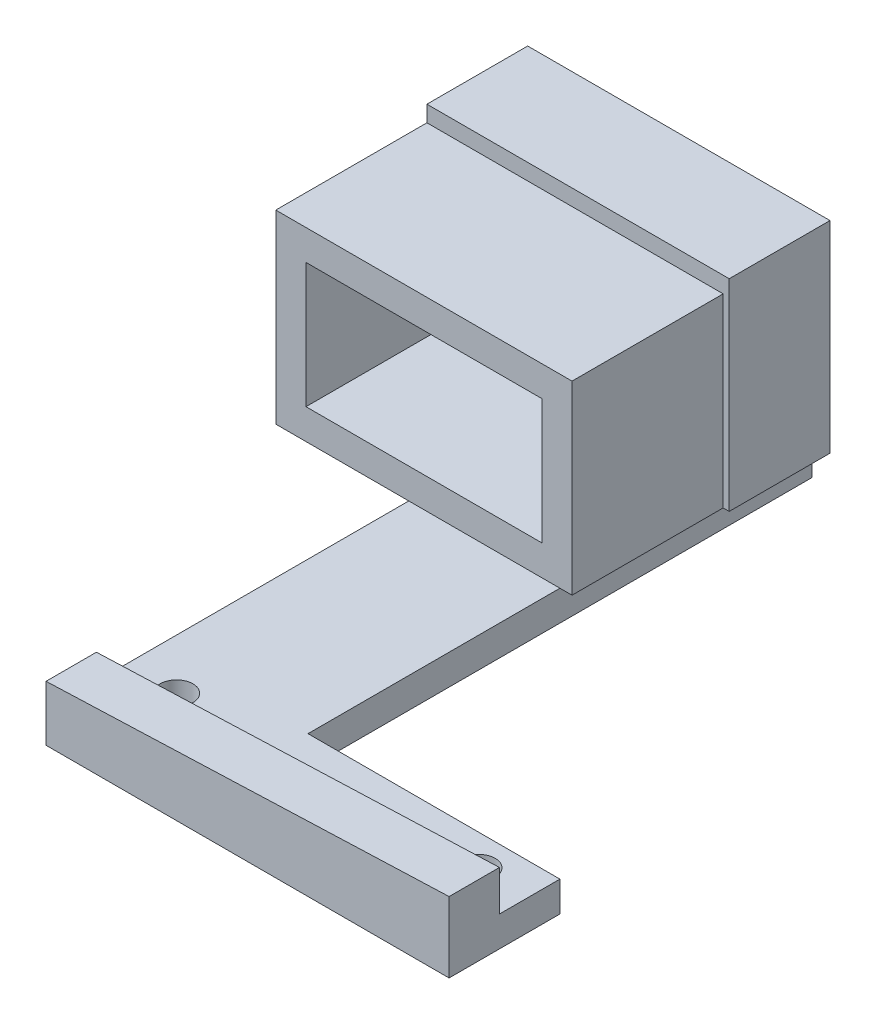
ISO-10303-21;
HEADER;
FILE_DESCRIPTION(('STEP AP214'),'2;1');
FILE_NAME('part.step','',(''),(''),'','','');
FILE_SCHEMA(('AUTOMOTIVE_DESIGN { 1 0 10303 214 1 1 1 1 }'));
ENDSEC;
DATA;
#1=APPLICATION_CONTEXT('core data for automotive mechanical design processes');
#2=APPLICATION_PROTOCOL_DEFINITION('international standard','automotive_design',2000,#1);
#3=PRODUCT_CONTEXT('',#1,'mechanical');
#4=PRODUCT('Part','Part','',(#3));
#5=PRODUCT_RELATED_PRODUCT_CATEGORY('part','',(#4));
#6=PRODUCT_DEFINITION_FORMATION('','',#4);
#7=PRODUCT_DEFINITION_CONTEXT('part definition',#1,'design');
#8=PRODUCT_DEFINITION('design','',#6,#7);
#9=PRODUCT_DEFINITION_SHAPE('','',#8);
#10=(LENGTH_UNIT() NAMED_UNIT(*) SI_UNIT(.MILLI.,.METRE.));
#11=(NAMED_UNIT(*) PLANE_ANGLE_UNIT() SI_UNIT($,.RADIAN.));
#12=(NAMED_UNIT(*) SI_UNIT($,.STERADIAN.) SOLID_ANGLE_UNIT());
#13=UNCERTAINTY_MEASURE_WITH_UNIT(LENGTH_MEASURE(1.E-05),#10,'distance_accuracy_value','');
#14=(GEOMETRIC_REPRESENTATION_CONTEXT(3) GLOBAL_UNCERTAINTY_ASSIGNED_CONTEXT((#13)) GLOBAL_UNIT_ASSIGNED_CONTEXT((#10,
#11,#12)) REPRESENTATION_CONTEXT('',''));
#15=CARTESIAN_POINT('',(0.,0.,0.));
#16=DIRECTION('',(0.,0.,1.));
#17=DIRECTION('',(1.,0.,0.));
#18=AXIS2_PLACEMENT_3D('',#15,#16,#17);
#19=CARTESIAN_POINT('',(0.,-4.,-6.));
#20=DIRECTION('',(0.,-1.,0.));
#21=DIRECTION('',(1.,0.,0.));
#22=AXIS2_PLACEMENT_3D('',#19,#20,#21);
#23=PLANE('',#22);
#24=CARTESIAN_POINT('',(35.,-4.,-2.94969975203685));
#25=DIRECTION('',(0.,1.,0.));
#26=DIRECTION('',(-1.,0.,0.));
#27=AXIS2_PLACEMENT_3D('',#24,#25,#26);
#28=CIRCLE('',#27,1.625);
#29=CARTESIAN_POINT('',(33.375,-4.,-2.94969975203685));
#30=VERTEX_POINT('',#29);
#31=EDGE_CURVE('E359',#30,#30,#28,.T.);
#32=ORIENTED_EDGE('',*,*,#31,.F.);
#33=EDGE_LOOP('',(#32));
#34=FACE_BOUND('',#33,.T.);
#35=CARTESIAN_POINT('',(5.,-4.,-2.94969975203685));
#36=DIRECTION('',(0.,1.,0.));
#37=DIRECTION('',(-1.,0.,0.));
#38=AXIS2_PLACEMENT_3D('',#35,#36,#37);
#39=CIRCLE('',#38,1.625);
#40=CARTESIAN_POINT('',(3.375,-4.,-2.94969975203685));
#41=VERTEX_POINT('',#40);
#42=EDGE_CURVE('E358',#41,#41,#39,.T.);
#43=ORIENTED_EDGE('',*,*,#42,.F.);
#44=EDGE_LOOP('',(#43));
#45=FACE_BOUND('',#44,.T.);
#46=DIRECTION('',(1.,0.,0.));
#47=VECTOR('',#46,1.);
#48=CARTESIAN_POINT('',(16.2,-4.,-31.));
#49=LINE('',#48,#47);
#50=CARTESIAN_POINT('',(0.,-4.,-31.));
#51=VERTEX_POINT('',#50);
#52=CARTESIAN_POINT('',(15.,-4.,-31.));
#53=VERTEX_POINT('',#52);
#54=EDGE_CURVE('E287',#51,#53,#49,.T.);
#55=ORIENTED_EDGE('',*,*,#54,.F.);
#56=DIRECTION('',(0.,0.,1.));
#57=VECTOR('',#56,1.);
#58=CARTESIAN_POINT('',(0.,-4.,-6.));
#59=LINE('',#58,#57);
#60=CARTESIAN_POINT('',(0.,-4.,0.));
#61=VERTEX_POINT('',#60);
#62=EDGE_CURVE('E383',#51,#61,#59,.T.);
#63=ORIENTED_EDGE('',*,*,#62,.T.);
#64=DIRECTION('',(1.,0.,0.));
#65=VECTOR('',#64,1.);
#66=CARTESIAN_POINT('',(0.,-4.,0.));
#67=LINE('',#66,#65);
#68=CARTESIAN_POINT('',(40.,-4.00000000000001,0.));
#69=VERTEX_POINT('',#68);
#70=EDGE_CURVE('E370',#61,#69,#67,.T.);
#71=ORIENTED_EDGE('',*,*,#70,.T.);
#72=DIRECTION('',(0.,0.,1.));
#73=VECTOR('',#72,1.);
#74=CARTESIAN_POINT('',(40.,-4.00000000000001,-6.));
#75=LINE('',#74,#73);
#76=CARTESIAN_POINT('',(40.,-4.00000000000001,-6.));
#77=VERTEX_POINT('',#76);
#78=EDGE_CURVE('E378',#77,#69,#75,.T.);
#79=ORIENTED_EDGE('',*,*,#78,.F.);
#80=DIRECTION('',(1.,0.,0.));
#81=VECTOR('',#80,1.);
#82=CARTESIAN_POINT('',(0.,-4.,-6.));
#83=LINE('',#82,#81);
#84=CARTESIAN_POINT('',(15.,-4.,-6.));
#85=VERTEX_POINT('',#84);
#86=EDGE_CURVE('E371',#85,#77,#83,.T.);
#87=ORIENTED_EDGE('',*,*,#86,.F.);
#88=DIRECTION('',(0.,0.,1.));
#89=VECTOR('',#88,1.);
#90=CARTESIAN_POINT('',(15.,-4.,-56.));
#91=LINE('',#90,#89);
#92=EDGE_CURVE('E350',#53,#85,#91,.T.);
#93=ORIENTED_EDGE('',*,*,#92,.F.);
#94=EDGE_LOOP('',(#55,#63,#71,#79,#87,#93));
#95=FACE_BOUND('',#94,.T.);
#96=ADVANCED_FACE('F33',(#34,#45,#95),#23,.F.);
#97=CARTESIAN_POINT('',(-13.2,-4.,-46.));
#98=DIRECTION('',(0.,0.,-1.));
#99=DIRECTION('',(-1.,0.,0.));
#100=AXIS2_PLACEMENT_3D('',#97,#98,#99);
#101=PLANE('',#100);
#102=DIRECTION('',(0.,1.,0.));
#103=VECTOR('',#102,1.);
#104=CARTESIAN_POINT('',(16.2,14.4,-46.));
#105=LINE('',#104,#103);
#106=CARTESIAN_POINT('',(16.2,-4.,-46.));
#107=VERTEX_POINT('',#106);
#108=CARTESIAN_POINT('',(16.2,14.4,-46.));
#109=VERTEX_POINT('',#108);
#110=EDGE_CURVE('E273',#107,#109,#105,.T.);
#111=ORIENTED_EDGE('',*,*,#110,.F.);
#112=DIRECTION('',(1.,0.,0.));
#113=VECTOR('',#112,1.);
#114=CARTESIAN_POINT('',(-13.2,-4.,-46.));
#115=LINE('',#114,#113);
#116=CARTESIAN_POINT('',(16.8,-4.,-46.));
#117=VERTEX_POINT('',#116);
#118=EDGE_CURVE('E306',#107,#117,#115,.T.);
#119=ORIENTED_EDGE('',*,*,#118,.T.);
#120=DIRECTION('',(0.,-1.,0.));
#121=VECTOR('',#120,1.);
#122=CARTESIAN_POINT('',(16.8,16.,-46.));
#123=LINE('',#122,#121);
#124=CARTESIAN_POINT('',(16.8,16.,-46.));
#125=VERTEX_POINT('',#124);
#126=EDGE_CURVE('E326',#125,#117,#123,.T.);
#127=ORIENTED_EDGE('',*,*,#126,.F.);
#128=DIRECTION('',(1.,0.,0.));
#129=VECTOR('',#128,1.);
#130=CARTESIAN_POINT('',(-13.2,16.,-46.));
#131=LINE('',#130,#129);
#132=CARTESIAN_POINT('',(-13.2,16.,-46.));
#133=VERTEX_POINT('',#132);
#134=EDGE_CURVE('E310',#133,#125,#131,.T.);
#135=ORIENTED_EDGE('',*,*,#134,.F.);
#136=DIRECTION('',(0.,1.,0.));
#137=VECTOR('',#136,1.);
#138=CARTESIAN_POINT('',(-13.2,-4.,-46.));
#139=LINE('',#138,#137);
#140=CARTESIAN_POINT('',(-13.2,14.4,-46.));
#141=VERTEX_POINT('',#140);
#142=EDGE_CURVE('E334',#141,#133,#139,.T.);
#143=ORIENTED_EDGE('',*,*,#142,.F.);
#144=DIRECTION('',(-1.,0.,0.));
#145=VECTOR('',#144,1.);
#146=CARTESIAN_POINT('',(16.2,14.4,-46.));
#147=LINE('',#146,#145);
#148=EDGE_CURVE('E290',#109,#141,#147,.T.);
#149=ORIENTED_EDGE('',*,*,#148,.F.);
#150=EDGE_LOOP('',(#111,#119,#127,#135,#143,#149));
#151=FACE_BOUND('',#150,.T.);
#152=ADVANCED_FACE('F461',(#151),#101,.F.);
#153=DIRECTION('',(1.,0.,0.));
#154=VECTOR('',#153,1.);
#155=CARTESIAN_POINT('',(16.2,-4.,-46.));
#156=LINE('',#155,#154);
#157=CARTESIAN_POINT('',(-13.2,-4.00000000000001,-46.));
#158=VERTEX_POINT('',#157);
#159=CARTESIAN_POINT('',(0.,-4.,-46.));
#160=VERTEX_POINT('',#159);
#161=EDGE_CURVE('E278',#158,#160,#156,.T.);
#162=ORIENTED_EDGE('',*,*,#161,.F.);
#163=CARTESIAN_POINT('',(-13.2,-7.,-46.));
#164=VERTEX_POINT('',#163);
#165=EDGE_CURVE('E335',#164,#158,#139,.T.);
#166=ORIENTED_EDGE('',*,*,#165,.F.);
#167=DIRECTION('',(1.,0.,0.));
#168=VECTOR('',#167,1.);
#169=CARTESIAN_POINT('',(-13.2,-7.,-46.));
#170=LINE('',#169,#168);
#171=CARTESIAN_POINT('',(0.,-7.,-46.));
#172=VERTEX_POINT('',#171);
#173=EDGE_CURVE('E338',#164,#172,#170,.T.);
#174=ORIENTED_EDGE('',*,*,#173,.T.);
#175=DIRECTION('',(0.,1.,0.));
#176=VECTOR('',#175,1.);
#177=CARTESIAN_POINT('',(0.,-4.,-46.));
#178=LINE('',#177,#176);
#179=EDGE_CURVE('E329',#172,#160,#178,.T.);
#180=ORIENTED_EDGE('',*,*,#179,.T.);
#181=EDGE_LOOP('',(#162,#166,#174,#180));
#182=FACE_BOUND('',#181,.T.);
#183=ADVANCED_FACE('F467',(#182),#101,.F.);
#184=CARTESIAN_POINT('',(0.,0.,5.));
#185=DIRECTION('',(1.,0.,0.));
#186=DIRECTION('',(0.,1.,0.));
#187=AXIS2_PLACEMENT_3D('',#184,#185,#186);
#188=PLANE('',#187);
#189=ORIENTED_EDGE('',*,*,#179,.F.);
#190=DIRECTION('',(0.,0.,-1.));
#191=VECTOR('',#190,1.);
#192=CARTESIAN_POINT('',(0.,-7.,5.));
#193=LINE('',#192,#191);
#194=CARTESIAN_POINT('',(0.,-7.,5.));
#195=VERTEX_POINT('',#194);
#196=EDGE_CURVE('E411',#195,#172,#193,.T.);
#197=ORIENTED_EDGE('',*,*,#196,.F.);
#198=DIRECTION('',(0.,-1.,0.));
#199=VECTOR('',#198,1.);
#200=CARTESIAN_POINT('',(0.,0.,5.));
#201=LINE('',#200,#199);
#202=CARTESIAN_POINT('',(0.,-1.50000000000001,5.));
#203=VERTEX_POINT('',#202);
#204=EDGE_CURVE('E395',#203,#195,#201,.T.);
#205=ORIENTED_EDGE('',*,*,#204,.F.);
#206=DIRECTION('',(0.,0.,1.));
#207=VECTOR('',#206,1.);
#208=CARTESIAN_POINT('',(0.,-1.50000000000001,0.));
#209=LINE('',#208,#207);
#210=CARTESIAN_POINT('',(0.,-1.50000000000001,0.));
#211=VERTEX_POINT('',#210);
#212=EDGE_CURVE('E391',#211,#203,#209,.T.);
#213=ORIENTED_EDGE('',*,*,#212,.F.);
#214=DIRECTION('',(0.,-1.,0.));
#215=VECTOR('',#214,1.);
#216=CARTESIAN_POINT('',(0.,0.,0.));
#217=LINE('',#216,#215);
#218=EDGE_CURVE('E394',#211,#61,#217,.T.);
#219=ORIENTED_EDGE('',*,*,#218,.T.);
#220=ORIENTED_EDGE('',*,*,#62,.F.);
#221=EDGE_CURVE('E384',#160,#51,#59,.T.);
#222=ORIENTED_EDGE('',*,*,#221,.F.);
#223=EDGE_LOOP('',(#189,#197,#205,#213,#219,#220,#222));
#224=FACE_BOUND('',#223,.T.);
#225=ADVANCED_FACE('F35',(#224),#188,.F.);
#226=CARTESIAN_POINT('',(0.,0.,0.));
#227=DIRECTION('',(0.,0.,1.));
#228=DIRECTION('',(1.,0.,0.));
#229=AXIS2_PLACEMENT_3D('',#226,#227,#228);
#230=PLANE('',#229);
#231=ORIENTED_EDGE('',*,*,#70,.F.);
#232=ORIENTED_EDGE('',*,*,#218,.F.);
#233=DIRECTION('',(0.999297615709181,0.0374736605890944,0.));
#234=VECTOR('',#233,1.);
#235=CARTESIAN_POINT('',(0.,-1.50000000000001,0.));
#236=LINE('',#235,#234);
#237=CARTESIAN_POINT('',(40.,0.,0.));
#238=VERTEX_POINT('',#237);
#239=EDGE_CURVE('E388',#211,#238,#236,.T.);
#240=ORIENTED_EDGE('',*,*,#239,.T.);
#241=DIRECTION('',(0.,1.,0.));
#242=VECTOR('',#241,1.);
#243=CARTESIAN_POINT('',(40.,0.,0.));
#244=LINE('',#243,#242);
#245=EDGE_CURVE('E398',#69,#238,#244,.T.);
#246=ORIENTED_EDGE('',*,*,#245,.F.);
#247=EDGE_LOOP('',(#231,#232,#240,#246));
#248=FACE_BOUND('',#247,.T.);
#249=ADVANCED_FACE('F485',(#248),#230,.F.);
#250=CARTESIAN_POINT('',(0.,-7.,5.));
#251=DIRECTION('',(0.,1.,0.));
#252=DIRECTION('',(0.,0.,1.));
#253=AXIS2_PLACEMENT_3D('',#250,#251,#252);
#254=PLANE('',#253);
#255=CARTESIAN_POINT('',(35.,-7.,-2.94969975203685));
#256=DIRECTION('',(0.,1.,0.));
#257=DIRECTION('',(0.,0.,1.));
#258=AXIS2_PLACEMENT_3D('',#255,#256,#257);
#259=CIRCLE('',#258,1.625);
#260=CARTESIAN_POINT('',(35.,-7.,-1.32469975203685));
#261=VERTEX_POINT('',#260);
#262=EDGE_CURVE('E367',#261,#261,#259,.T.);
#263=ORIENTED_EDGE('',*,*,#262,.T.);
#264=EDGE_LOOP('',(#263));
#265=FACE_BOUND('',#264,.T.);
#266=CARTESIAN_POINT('',(5.,-7.,-2.94969975203685));
#267=DIRECTION('',(0.,1.,0.));
#268=DIRECTION('',(0.,0.,1.));
#269=AXIS2_PLACEMENT_3D('',#266,#267,#268);
#270=CIRCLE('',#269,1.625);
#271=CARTESIAN_POINT('',(5.,-7.,-1.32469975203685));
#272=VERTEX_POINT('',#271);
#273=EDGE_CURVE('E362',#272,#272,#270,.T.);
#274=ORIENTED_EDGE('',*,*,#273,.T.);
#275=EDGE_LOOP('',(#274));
#276=FACE_BOUND('',#275,.T.);
#277=ORIENTED_EDGE('',*,*,#196,.T.);
#278=ORIENTED_EDGE('',*,*,#173,.F.);
#279=DIRECTION('',(0.,0.,1.));
#280=VECTOR('',#279,1.);
#281=CARTESIAN_POINT('',(-13.2,-7.,-56.));
#282=LINE('',#281,#280);
#283=CARTESIAN_POINT('',(-13.2,-7.,-56.));
#284=VERTEX_POINT('',#283);
#285=EDGE_CURVE('E331',#284,#164,#282,.T.);
#286=ORIENTED_EDGE('',*,*,#285,.F.);
#287=DIRECTION('',(-1.,0.,0.));
#288=VECTOR('',#287,1.);
#289=CARTESIAN_POINT('',(15.,-7.,-56.));
#290=LINE('',#289,#288);
#291=CARTESIAN_POINT('',(15.,-7.,-56.));
#292=VERTEX_POINT('',#291);
#293=EDGE_CURVE('E347',#292,#284,#290,.T.);
#294=ORIENTED_EDGE('',*,*,#293,.F.);
#295=DIRECTION('',(0.,0.,1.));
#296=VECTOR('',#295,1.);
#297=CARTESIAN_POINT('',(15.,-7.,-56.));
#298=LINE('',#297,#296);
#299=CARTESIAN_POINT('',(15.,-7.,-6.));
#300=VERTEX_POINT('',#299);
#301=EDGE_CURVE('E355',#292,#300,#298,.T.);
#302=ORIENTED_EDGE('',*,*,#301,.T.);
#303=DIRECTION('',(-1.,0.,0.));
#304=VECTOR('',#303,1.);
#305=CARTESIAN_POINT('',(0.,-7.,-6.));
#306=LINE('',#305,#304);
#307=CARTESIAN_POINT('',(40.,-7.00000000000001,-6.));
#308=VERTEX_POINT('',#307);
#309=EDGE_CURVE('E376',#308,#300,#306,.T.);
#310=ORIENTED_EDGE('',*,*,#309,.F.);
#311=DIRECTION('',(0.,0.,-1.));
#312=VECTOR('',#311,1.);
#313=CARTESIAN_POINT('',(40.,-7.,5.));
#314=LINE('',#313,#312);
#315=CARTESIAN_POINT('',(40.,-7.,5.));
#316=VERTEX_POINT('',#315);
#317=EDGE_CURVE('E409',#316,#308,#314,.T.);
#318=ORIENTED_EDGE('',*,*,#317,.F.);
#319=DIRECTION('',(1.,0.,0.));
#320=VECTOR('',#319,1.);
#321=CARTESIAN_POINT('',(0.,-7.,5.));
#322=LINE('',#321,#320);
#323=EDGE_CURVE('E397',#195,#316,#322,.T.);
#324=ORIENTED_EDGE('',*,*,#323,.F.);
#325=EDGE_LOOP('',(#277,#278,#286,#294,#302,#310,#318,#324));
#326=FACE_BOUND('',#325,.T.);
#327=ADVANCED_FACE('F488',(#265,#276,#326),#254,.F.);
#328=CARTESIAN_POINT('',(40.,0.,5.));
#329=DIRECTION('',(-1.,0.,0.));
#330=DIRECTION('',(0.,0.,1.));
#331=AXIS2_PLACEMENT_3D('',#328,#329,#330);
#332=PLANE('',#331);
#333=ORIENTED_EDGE('',*,*,#317,.T.);
#334=DIRECTION('',(0.,-1.,0.));
#335=VECTOR('',#334,1.);
#336=CARTESIAN_POINT('',(40.,-7.00000000000001,-6.));
#337=LINE('',#336,#335);
#338=EDGE_CURVE('E373',#77,#308,#337,.T.);
#339=ORIENTED_EDGE('',*,*,#338,.F.);
#340=ORIENTED_EDGE('',*,*,#78,.T.);
#341=ORIENTED_EDGE('',*,*,#245,.T.);
#342=DIRECTION('',(0.,0.,-1.));
#343=VECTOR('',#342,1.);
#344=CARTESIAN_POINT('',(40.,0.,5.));
#345=LINE('',#344,#343);
#346=CARTESIAN_POINT('',(40.,0.,5.));
#347=VERTEX_POINT('',#346);
#348=EDGE_CURVE('E403',#347,#238,#345,.T.);
#349=ORIENTED_EDGE('',*,*,#348,.F.);
#350=DIRECTION('',(0.,1.,0.));
#351=VECTOR('',#350,1.);
#352=CARTESIAN_POINT('',(40.,0.,5.));
#353=LINE('',#352,#351);
#354=EDGE_CURVE('E400',#316,#347,#353,.T.);
#355=ORIENTED_EDGE('',*,*,#354,.F.);
#356=EDGE_LOOP('',(#333,#339,#340,#341,#349,#355));
#357=FACE_BOUND('',#356,.T.);
#358=ADVANCED_FACE('F483',(#357),#332,.F.);
#359=CARTESIAN_POINT('',(0.,0.,5.));
#360=DIRECTION('',(0.,0.,1.));
#361=DIRECTION('',(1.,0.,0.));
#362=AXIS2_PLACEMENT_3D('',#359,#360,#361);
#363=PLANE('',#362);
#364=DIRECTION('',(0.999297615709181,0.0374736605890944,0.));
#365=VECTOR('',#364,1.);
#366=CARTESIAN_POINT('',(0.,-1.50000000000001,5.));
#367=LINE('',#366,#365);
#368=EDGE_CURVE('E387',#203,#347,#367,.T.);
#369=ORIENTED_EDGE('',*,*,#368,.F.);
#370=ORIENTED_EDGE('',*,*,#204,.T.);
#371=ORIENTED_EDGE('',*,*,#323,.T.);
#372=ORIENTED_EDGE('',*,*,#354,.T.);
#373=EDGE_LOOP('',(#369,#370,#371,#372));
#374=FACE_BOUND('',#373,.T.);
#375=ADVANCED_FACE('F479',(#374),#363,.T.);
#376=CARTESIAN_POINT('',(0.,-1.50000000000001,0.));
#377=DIRECTION('',(0.0374736605890944,-0.999297615709181,0.));
#378=DIRECTION('',(0.999297615709181,0.0374736605890944,0.));
#379=AXIS2_PLACEMENT_3D('',#376,#377,#378);
#380=PLANE('',#379);
#381=ORIENTED_EDGE('',*,*,#368,.T.);
#382=ORIENTED_EDGE('',*,*,#348,.T.);
#383=ORIENTED_EDGE('',*,*,#239,.F.);
#384=ORIENTED_EDGE('',*,*,#212,.T.);
#385=EDGE_LOOP('',(#381,#382,#383,#384));
#386=FACE_BOUND('',#385,.T.);
#387=ADVANCED_FACE('F476',(#386),#380,.F.);
#388=CARTESIAN_POINT('',(0.,0.,-6.));
#389=DIRECTION('',(0.,0.,-1.));
#390=DIRECTION('',(-1.,0.,0.));
#391=AXIS2_PLACEMENT_3D('',#388,#389,#390);
#392=PLANE('',#391);
#393=DIRECTION('',(0.,-1.,0.));
#394=VECTOR('',#393,1.);
#395=CARTESIAN_POINT('',(15.,-4.,-6.));
#396=LINE('',#395,#394);
#397=EDGE_CURVE('E343',#85,#300,#396,.T.);
#398=ORIENTED_EDGE('',*,*,#397,.F.);
#399=ORIENTED_EDGE('',*,*,#86,.T.);
#400=ORIENTED_EDGE('',*,*,#338,.T.);
#401=ORIENTED_EDGE('',*,*,#309,.T.);
#402=EDGE_LOOP('',(#398,#399,#400,#401));
#403=FACE_BOUND('',#402,.T.);
#404=ADVANCED_FACE('F474',(#403),#392,.T.);
#405=CARTESIAN_POINT('',(5.,-10.,-2.94969975203685));
#406=DIRECTION('',(0.,1.,0.));
#407=DIRECTION('',(-1.,0.,0.));
#408=AXIS2_PLACEMENT_3D('',#405,#406,#407);
#409=CYLINDRICAL_SURFACE('',#408,1.625);
#410=ORIENTED_EDGE('',*,*,#42,.T.);
#411=EDGE_LOOP('',(#410));
#412=FACE_BOUND('',#411,.T.);
#413=ORIENTED_EDGE('',*,*,#273,.F.);
#414=EDGE_LOOP('',(#413));
#415=FACE_BOUND('',#414,.T.);
#416=ADVANCED_FACE('F584',(#412,#415),#409,.F.);
#417=CARTESIAN_POINT('',(35.,-10.,-2.94969975203685));
#418=DIRECTION('',(0.,1.,0.));
#419=DIRECTION('',(-1.,0.,0.));
#420=AXIS2_PLACEMENT_3D('',#417,#418,#419);
#421=CYLINDRICAL_SURFACE('',#420,1.625);
#422=ORIENTED_EDGE('',*,*,#31,.T.);
#423=EDGE_LOOP('',(#422));
#424=FACE_BOUND('',#423,.T.);
#425=ORIENTED_EDGE('',*,*,#262,.F.);
#426=EDGE_LOOP('',(#425));
#427=FACE_BOUND('',#426,.T.);
#428=ADVANCED_FACE('F582',(#424,#427),#421,.F.);
#429=CARTESIAN_POINT('',(15.,-4.,-56.));
#430=DIRECTION('',(-1.,0.,0.));
#431=DIRECTION('',(0.,0.,1.));
#432=AXIS2_PLACEMENT_3D('',#429,#430,#431);
#433=PLANE('',#432);
#434=ORIENTED_EDGE('',*,*,#397,.T.);
#435=ORIENTED_EDGE('',*,*,#301,.F.);
#436=DIRECTION('',(0.,-1.,0.));
#437=VECTOR('',#436,1.);
#438=CARTESIAN_POINT('',(15.,-4.,-56.));
#439=LINE('',#438,#437);
#440=CARTESIAN_POINT('',(15.,-4.,-56.));
#441=VERTEX_POINT('',#440);
#442=EDGE_CURVE('E344',#441,#292,#439,.T.);
#443=ORIENTED_EDGE('',*,*,#442,.F.);
#444=EDGE_CURVE('E353',#441,#53,#91,.T.);
#445=ORIENTED_EDGE('',*,*,#444,.T.);
#446=ORIENTED_EDGE('',*,*,#92,.T.);
#447=EDGE_LOOP('',(#434,#435,#443,#445,#446));
#448=FACE_BOUND('',#447,.T.);
#449=ADVANCED_FACE('F544',(#448),#433,.F.);
#450=CARTESIAN_POINT('',(0.,0.,-56.));
#451=DIRECTION('',(0.,0.,-1.));
#452=DIRECTION('',(-1.,0.,0.));
#453=AXIS2_PLACEMENT_3D('',#450,#451,#452);
#454=PLANE('',#453);
#455=DIRECTION('',(-1.,0.,0.));
#456=VECTOR('',#455,1.);
#457=CARTESIAN_POINT('',(-13.2,3.,-56.));
#458=LINE('',#457,#456);
#459=CARTESIAN_POINT('',(-3.19999999999999,3.,-56.));
#460=VERTEX_POINT('',#459);
#461=CARTESIAN_POINT('',(-13.2,3.,-56.));
#462=VERTEX_POINT('',#461);
#463=EDGE_CURVE('E226',#460,#462,#458,.T.);
#464=ORIENTED_EDGE('',*,*,#463,.F.);
#465=DIRECTION('',(0.,-1.,0.));
#466=VECTOR('',#465,1.);
#467=CARTESIAN_POINT('',(-3.19999999999999,8.,-56.));
#468=LINE('',#467,#466);
#469=CARTESIAN_POINT('',(-3.19999999999999,8.,-56.));
#470=VERTEX_POINT('',#469);
#471=EDGE_CURVE('E530',#470,#460,#468,.T.);
#472=ORIENTED_EDGE('',*,*,#471,.F.);
#473=DIRECTION('',(1.,0.,0.));
#474=VECTOR('',#473,1.);
#475=CARTESIAN_POINT('',(-13.2,8.,-56.));
#476=LINE('',#475,#474);
#477=CARTESIAN_POINT('',(-13.2,8.,-56.));
#478=VERTEX_POINT('',#477);
#479=EDGE_CURVE('E528',#478,#470,#476,.T.);
#480=ORIENTED_EDGE('',*,*,#479,.F.);
#481=DIRECTION('',(0.,-1.,0.));
#482=VECTOR('',#481,1.);
#483=CARTESIAN_POINT('',(-13.2,-4.,-56.));
#484=LINE('',#483,#482);
#485=CARTESIAN_POINT('',(-13.2,16.,-56.));
#486=VERTEX_POINT('',#485);
#487=EDGE_CURVE('E231',#486,#478,#484,.T.);
#488=ORIENTED_EDGE('',*,*,#487,.F.);
#489=DIRECTION('',(-1.,0.,0.));
#490=VECTOR('',#489,1.);
#491=CARTESIAN_POINT('',(-13.2,16.,-56.));
#492=LINE('',#491,#490);
#493=CARTESIAN_POINT('',(16.8,16.,-56.));
#494=VERTEX_POINT('',#493);
#495=EDGE_CURVE('E315',#494,#486,#492,.T.);
#496=ORIENTED_EDGE('',*,*,#495,.F.);
#497=DIRECTION('',(0.,-1.,0.));
#498=VECTOR('',#497,1.);
#499=CARTESIAN_POINT('',(16.8,16.,-56.));
#500=LINE('',#499,#498);
#501=CARTESIAN_POINT('',(16.8,-4.,-56.));
#502=VERTEX_POINT('',#501);
#503=EDGE_CURVE('E318',#494,#502,#500,.T.);
#504=ORIENTED_EDGE('',*,*,#503,.T.);
#505=DIRECTION('',(-1.,0.,0.));
#506=VECTOR('',#505,1.);
#507=CARTESIAN_POINT('',(-13.2,-4.,-56.));
#508=LINE('',#507,#506);
#509=EDGE_CURVE('E311',#502,#441,#508,.T.);
#510=ORIENTED_EDGE('',*,*,#509,.T.);
#511=ORIENTED_EDGE('',*,*,#442,.T.);
#512=ORIENTED_EDGE('',*,*,#293,.T.);
#513=EDGE_CURVE('E332',#462,#284,#484,.T.);
#514=ORIENTED_EDGE('',*,*,#513,.F.);
#515=EDGE_LOOP('',(#464,#472,#480,#488,#496,#504,#510,#511,#512,#514));
#516=FACE_BOUND('',#515,.T.);
#517=ADVANCED_FACE('F525',(#516),#454,.T.);
#518=CARTESIAN_POINT('',(-13.2,0.,0.));
#519=DIRECTION('',(-1.,0.,0.));
#520=DIRECTION('',(0.,-1.,0.));
#521=AXIS2_PLACEMENT_3D('',#518,#519,#520);
#522=PLANE('',#521);
#523=DIRECTION('',(0.,0.,-1.));
#524=VECTOR('',#523,1.);
#525=CARTESIAN_POINT('',(-13.2,3.,-41.));
#526=LINE('',#525,#524);
#527=CARTESIAN_POINT('',(-13.2,3.,-41.));
#528=VERTEX_POINT('',#527);
#529=EDGE_CURVE('E48',#528,#462,#526,.T.);
#530=ORIENTED_EDGE('',*,*,#529,.T.);
#531=ORIENTED_EDGE('',*,*,#513,.T.);
#532=ORIENTED_EDGE('',*,*,#285,.T.);
#533=ORIENTED_EDGE('',*,*,#165,.T.);
#534=DIRECTION('',(0.,0.,-1.));
#535=VECTOR('',#534,1.);
#536=CARTESIAN_POINT('',(-13.2,-4.00000000000001,-31.));
#537=LINE('',#536,#535);
#538=CARTESIAN_POINT('',(-13.2,-4.00000000000001,-31.));
#539=VERTEX_POINT('',#538);
#540=EDGE_CURVE('E297',#539,#158,#537,.T.);
#541=ORIENTED_EDGE('',*,*,#540,.F.);
#542=DIRECTION('',(0.,-1.,0.));
#543=VECTOR('',#542,1.);
#544=CARTESIAN_POINT('',(-13.2,14.4,-31.));
#545=LINE('',#544,#543);
#546=CARTESIAN_POINT('',(-13.2,14.4,-31.));
#547=VERTEX_POINT('',#546);
#548=EDGE_CURVE('E280',#547,#539,#545,.T.);
#549=ORIENTED_EDGE('',*,*,#548,.F.);
#550=DIRECTION('',(0.,0.,-1.));
#551=VECTOR('',#550,1.);
#552=CARTESIAN_POINT('',(-13.2,14.4,-31.));
#553=LINE('',#552,#551);
#554=EDGE_CURVE('E300',#547,#141,#553,.T.);
#555=ORIENTED_EDGE('',*,*,#554,.T.);
#556=ORIENTED_EDGE('',*,*,#142,.T.);
#557=DIRECTION('',(0.,0.,1.));
#558=VECTOR('',#557,1.);
#559=CARTESIAN_POINT('',(-13.2,16.,-46.));
#560=LINE('',#559,#558);
#561=EDGE_CURVE('E307',#486,#133,#560,.T.);
#562=ORIENTED_EDGE('',*,*,#561,.F.);
#563=ORIENTED_EDGE('',*,*,#487,.T.);
#564=DIRECTION('',(0.,0.,-1.));
#565=VECTOR('',#564,1.);
#566=CARTESIAN_POINT('',(-13.2,8.,-41.));
#567=LINE('',#566,#565);
#568=CARTESIAN_POINT('',(-13.2,8.,-41.));
#569=VERTEX_POINT('',#568);
#570=EDGE_CURVE('E214',#569,#478,#567,.T.);
#571=ORIENTED_EDGE('',*,*,#570,.F.);
#572=DIRECTION('',(0.,1.,0.));
#573=VECTOR('',#572,1.);
#574=CARTESIAN_POINT('',(-13.2,8.,-41.));
#575=LINE('',#574,#573);
#576=EDGE_CURVE('E221',#528,#569,#575,.T.);
#577=ORIENTED_EDGE('',*,*,#576,.F.);
#578=EDGE_LOOP('',(#530,#531,#532,#533,#541,#549,#555,#556,#562,#563,#571,#577));
#579=FACE_BOUND('',#578,.T.);
#580=ADVANCED_FACE('F229',(#579),#522,.T.);
#581=CARTESIAN_POINT('',(0.,-4.,0.));
#582=DIRECTION('',(0.,-1.,0.));
#583=DIRECTION('',(1.,0.,0.));
#584=AXIS2_PLACEMENT_3D('',#581,#582,#583);
#585=PLANE('',#584);
#586=ORIENTED_EDGE('',*,*,#444,.F.);
#587=ORIENTED_EDGE('',*,*,#509,.F.);
#588=DIRECTION('',(0.,0.,-1.));
#589=VECTOR('',#588,1.);
#590=CARTESIAN_POINT('',(16.8,-4.,-46.));
#591=LINE('',#590,#589);
#592=EDGE_CURVE('E320',#117,#502,#591,.T.);
#593=ORIENTED_EDGE('',*,*,#592,.F.);
#594=ORIENTED_EDGE('',*,*,#118,.F.);
#595=DIRECTION('',(0.,0.,-1.));
#596=VECTOR('',#595,1.);
#597=CARTESIAN_POINT('',(16.2,-4.,-31.));
#598=LINE('',#597,#596);
#599=CARTESIAN_POINT('',(16.2,-4.,-31.));
#600=VERTEX_POINT('',#599);
#601=EDGE_CURVE('E286',#600,#107,#598,.T.);
#602=ORIENTED_EDGE('',*,*,#601,.F.);
#603=EDGE_CURVE('E282',#53,#600,#49,.T.);
#604=ORIENTED_EDGE('',*,*,#603,.F.);
#605=EDGE_LOOP('',(#586,#587,#593,#594,#602,#604));
#606=FACE_BOUND('',#605,.T.);
#607=ADVANCED_FACE('F562',(#606),#585,.T.);
#608=CARTESIAN_POINT('',(16.8,16.,-46.));
#609=DIRECTION('',(-1.,0.,0.));
#610=DIRECTION('',(0.,-1.,0.));
#611=AXIS2_PLACEMENT_3D('',#608,#609,#610);
#612=PLANE('',#611);
#613=ORIENTED_EDGE('',*,*,#592,.T.);
#614=ORIENTED_EDGE('',*,*,#503,.F.);
#615=DIRECTION('',(0.,0.,-1.));
#616=VECTOR('',#615,1.);
#617=CARTESIAN_POINT('',(16.8,16.,-46.));
#618=LINE('',#617,#616);
#619=EDGE_CURVE('E313',#125,#494,#618,.T.);
#620=ORIENTED_EDGE('',*,*,#619,.F.);
#621=ORIENTED_EDGE('',*,*,#126,.T.);
#622=EDGE_LOOP('',(#613,#614,#620,#621));
#623=FACE_BOUND('',#622,.T.);
#624=ADVANCED_FACE('F565',(#623),#612,.F.);
#625=CARTESIAN_POINT('',(0.,16.,0.));
#626=DIRECTION('',(0.,-1.,0.));
#627=DIRECTION('',(1.,0.,0.));
#628=AXIS2_PLACEMENT_3D('',#625,#626,#627);
#629=PLANE('',#628);
#630=ORIENTED_EDGE('',*,*,#561,.T.);
#631=ORIENTED_EDGE('',*,*,#134,.T.);
#632=ORIENTED_EDGE('',*,*,#619,.T.);
#633=ORIENTED_EDGE('',*,*,#495,.T.);
#634=EDGE_LOOP('',(#630,#631,#632,#633));
#635=FACE_BOUND('',#634,.T.);
#636=ADVANCED_FACE('F456',(#635),#629,.F.);
#637=CARTESIAN_POINT('',(16.2,-4.,-31.));
#638=DIRECTION('',(0.,1.,0.));
#639=DIRECTION('',(-1.,0.,0.));
#640=AXIS2_PLACEMENT_3D('',#637,#638,#639);
#641=PLANE('',#640);
#642=ORIENTED_EDGE('',*,*,#161,.T.);
#643=ORIENTED_EDGE('',*,*,#221,.T.);
#644=EDGE_CURVE('E283',#539,#51,#49,.T.);
#645=ORIENTED_EDGE('',*,*,#644,.F.);
#646=ORIENTED_EDGE('',*,*,#540,.T.);
#647=EDGE_LOOP('',(#642,#643,#645,#646));
#648=FACE_BOUND('',#647,.T.);
#649=ADVANCED_FACE('F446',(#648),#641,.F.);
#650=CARTESIAN_POINT('',(0.,0.,-31.));
#651=DIRECTION('',(0.,0.,-1.));
#652=DIRECTION('',(-1.,0.,0.));
#653=AXIS2_PLACEMENT_3D('',#650,#651,#652);
#654=PLANE('',#653);
#655=DIRECTION('',(0.,1.,0.));
#656=VECTOR('',#655,1.);
#657=CARTESIAN_POINT('',(16.2,14.4,-31.));
#658=LINE('',#657,#656);
#659=CARTESIAN_POINT('',(16.2,14.4,-31.));
#660=VERTEX_POINT('',#659);
#661=EDGE_CURVE('E274',#600,#660,#658,.T.);
#662=ORIENTED_EDGE('',*,*,#661,.T.);
#663=DIRECTION('',(-1.,0.,0.));
#664=VECTOR('',#663,1.);
#665=CARTESIAN_POINT('',(16.2,14.4,-31.));
#666=LINE('',#665,#664);
#667=EDGE_CURVE('E277',#660,#547,#666,.T.);
#668=ORIENTED_EDGE('',*,*,#667,.T.);
#669=ORIENTED_EDGE('',*,*,#548,.T.);
#670=ORIENTED_EDGE('',*,*,#644,.T.);
#671=ORIENTED_EDGE('',*,*,#54,.T.);
#672=ORIENTED_EDGE('',*,*,#603,.T.);
#673=EDGE_LOOP('',(#662,#668,#669,#670,#671,#672));
#674=FACE_BOUND('',#673,.T.);
#675=DIRECTION('',(0.,1.,0.));
#676=VECTOR('',#675,1.);
#677=CARTESIAN_POINT('',(13.2,11.4,-31.));
#678=LINE('',#677,#676);
#679=CARTESIAN_POINT('',(13.2,-1.,-31.));
#680=VERTEX_POINT('',#679);
#681=CARTESIAN_POINT('',(13.2,11.4,-31.));
#682=VERTEX_POINT('',#681);
#683=EDGE_CURVE('E242',#680,#682,#678,.T.);
#684=ORIENTED_EDGE('',*,*,#683,.F.);
#685=DIRECTION('',(1.,0.,0.));
#686=VECTOR('',#685,1.);
#687=CARTESIAN_POINT('',(13.2,-1.,-31.));
#688=LINE('',#687,#686);
#689=CARTESIAN_POINT('',(-10.2,-1.,-31.));
#690=VERTEX_POINT('',#689);
#691=EDGE_CURVE('E250',#690,#680,#688,.T.);
#692=ORIENTED_EDGE('',*,*,#691,.F.);
#693=DIRECTION('',(0.,-1.,0.));
#694=VECTOR('',#693,1.);
#695=CARTESIAN_POINT('',(-10.2,11.4,-31.));
#696=LINE('',#695,#694);
#697=CARTESIAN_POINT('',(-10.2,11.4,-31.));
#698=VERTEX_POINT('',#697);
#699=EDGE_CURVE('E247',#698,#690,#696,.T.);
#700=ORIENTED_EDGE('',*,*,#699,.F.);
#701=DIRECTION('',(-1.,0.,0.));
#702=VECTOR('',#701,1.);
#703=CARTESIAN_POINT('',(13.2,11.4,-31.));
#704=LINE('',#703,#702);
#705=EDGE_CURVE('E244',#682,#698,#704,.T.);
#706=ORIENTED_EDGE('',*,*,#705,.F.);
#707=EDGE_LOOP('',(#684,#692,#700,#706));
#708=FACE_BOUND('',#707,.T.);
#709=ADVANCED_FACE('F443',(#674,#708),#654,.F.);
#710=CARTESIAN_POINT('',(16.2,14.4,-31.));
#711=DIRECTION('',(-1.,0.,0.));
#712=DIRECTION('',(0.,-1.,0.));
#713=AXIS2_PLACEMENT_3D('',#710,#711,#712);
#714=PLANE('',#713);
#715=ORIENTED_EDGE('',*,*,#110,.T.);
#716=DIRECTION('',(0.,0.,-1.));
#717=VECTOR('',#716,1.);
#718=CARTESIAN_POINT('',(16.2,14.4,-31.));
#719=LINE('',#718,#717);
#720=EDGE_CURVE('E303',#660,#109,#719,.T.);
#721=ORIENTED_EDGE('',*,*,#720,.F.);
#722=ORIENTED_EDGE('',*,*,#661,.F.);
#723=ORIENTED_EDGE('',*,*,#601,.T.);
#724=EDGE_LOOP('',(#715,#721,#722,#723));
#725=FACE_BOUND('',#724,.T.);
#726=ADVANCED_FACE('F445',(#725),#714,.F.);
#727=CARTESIAN_POINT('',(16.2,14.4,-31.));
#728=DIRECTION('',(0.,-1.,0.));
#729=DIRECTION('',(1.,0.,0.));
#730=AXIS2_PLACEMENT_3D('',#727,#728,#729);
#731=PLANE('',#730);
#732=ORIENTED_EDGE('',*,*,#148,.T.);
#733=ORIENTED_EDGE('',*,*,#554,.F.);
#734=ORIENTED_EDGE('',*,*,#667,.F.);
#735=ORIENTED_EDGE('',*,*,#720,.T.);
#736=EDGE_LOOP('',(#732,#733,#734,#735));
#737=FACE_BOUND('',#736,.T.);
#738=ADVANCED_FACE('F453',(#737),#731,.F.);
#739=CARTESIAN_POINT('',(13.2,11.4,-31.));
#740=DIRECTION('',(-1.,0.,0.));
#741=DIRECTION('',(0.,-1.,0.));
#742=AXIS2_PLACEMENT_3D('',#739,#740,#741);
#743=PLANE('',#742);
#744=DIRECTION('',(0.,1.,0.));
#745=VECTOR('',#744,1.);
#746=CARTESIAN_POINT('',(13.2,11.4,-46.));
#747=LINE('',#746,#745);
#748=CARTESIAN_POINT('',(13.2,-1.,-46.));
#749=VERTEX_POINT('',#748);
#750=CARTESIAN_POINT('',(13.2,11.4,-46.));
#751=VERTEX_POINT('',#750);
#752=EDGE_CURVE('E241',#749,#751,#747,.T.);
#753=ORIENTED_EDGE('',*,*,#752,.F.);
#754=DIRECTION('',(0.,0.,-1.));
#755=VECTOR('',#754,1.);
#756=CARTESIAN_POINT('',(13.2,-1.,-31.));
#757=LINE('',#756,#755);
#758=EDGE_CURVE('E252',#680,#749,#757,.T.);
#759=ORIENTED_EDGE('',*,*,#758,.F.);
#760=ORIENTED_EDGE('',*,*,#683,.T.);
#761=DIRECTION('',(0.,0.,-1.));
#762=VECTOR('',#761,1.);
#763=CARTESIAN_POINT('',(13.2,11.4,-31.));
#764=LINE('',#763,#762);
#765=EDGE_CURVE('E270',#682,#751,#764,.T.);
#766=ORIENTED_EDGE('',*,*,#765,.T.);
#767=EDGE_LOOP('',(#753,#759,#760,#766));
#768=FACE_BOUND('',#767,.T.);
#769=ADVANCED_FACE('F436',(#768),#743,.T.);
#770=CARTESIAN_POINT('',(13.2,11.4,-31.));
#771=DIRECTION('',(0.,-1.,0.));
#772=DIRECTION('',(1.,0.,0.));
#773=AXIS2_PLACEMENT_3D('',#770,#771,#772);
#774=PLANE('',#773);
#775=DIRECTION('',(-1.,0.,0.));
#776=VECTOR('',#775,1.);
#777=CARTESIAN_POINT('',(13.2,11.4,-46.));
#778=LINE('',#777,#776);
#779=CARTESIAN_POINT('',(-10.2,11.4,-46.));
#780=VERTEX_POINT('',#779);
#781=EDGE_CURVE('E255',#751,#780,#778,.T.);
#782=ORIENTED_EDGE('',*,*,#781,.F.);
#783=ORIENTED_EDGE('',*,*,#765,.F.);
#784=ORIENTED_EDGE('',*,*,#705,.T.);
#785=DIRECTION('',(0.,0.,-1.));
#786=VECTOR('',#785,1.);
#787=CARTESIAN_POINT('',(-10.2,11.4,-31.));
#788=LINE('',#787,#786);
#789=EDGE_CURVE('E268',#698,#780,#788,.T.);
#790=ORIENTED_EDGE('',*,*,#789,.T.);
#791=EDGE_LOOP('',(#782,#783,#784,#790));
#792=FACE_BOUND('',#791,.T.);
#793=ADVANCED_FACE('F441',(#792),#774,.T.);
#794=CARTESIAN_POINT('',(-10.2,11.4,-31.));
#795=DIRECTION('',(1.,0.,0.));
#796=DIRECTION('',(0.,1.,0.));
#797=AXIS2_PLACEMENT_3D('',#794,#795,#796);
#798=PLANE('',#797);
#799=DIRECTION('',(0.,0.,-1.));
#800=VECTOR('',#799,1.);
#801=CARTESIAN_POINT('',(-10.2,3.,-31.));
#802=LINE('',#801,#800);
#803=CARTESIAN_POINT('',(-10.2,3.,-41.));
#804=VERTEX_POINT('',#803);
#805=CARTESIAN_POINT('',(-10.2,3.,-46.));
#806=VERTEX_POINT('',#805);
#807=EDGE_CURVE('E239',#804,#806,#802,.T.);
#808=ORIENTED_EDGE('',*,*,#807,.F.);
#809=DIRECTION('',(0.,-1.,0.));
#810=VECTOR('',#809,1.);
#811=CARTESIAN_POINT('',(-10.2,11.4,-41.));
#812=LINE('',#811,#810);
#813=CARTESIAN_POINT('',(-10.2,8.,-41.));
#814=VERTEX_POINT('',#813);
#815=EDGE_CURVE('E11',#814,#804,#812,.T.);
#816=ORIENTED_EDGE('',*,*,#815,.F.);
#817=DIRECTION('',(0.,0.,1.));
#818=VECTOR('',#817,1.);
#819=CARTESIAN_POINT('',(-10.2,8.,-31.));
#820=LINE('',#819,#818);
#821=CARTESIAN_POINT('',(-10.2,8.,-46.));
#822=VERTEX_POINT('',#821);
#823=EDGE_CURVE('E217',#822,#814,#820,.T.);
#824=ORIENTED_EDGE('',*,*,#823,.F.);
#825=DIRECTION('',(0.,-1.,0.));
#826=VECTOR('',#825,1.);
#827=CARTESIAN_POINT('',(-10.2,11.4,-46.));
#828=LINE('',#827,#826);
#829=EDGE_CURVE('E259',#780,#822,#828,.T.);
#830=ORIENTED_EDGE('',*,*,#829,.F.);
#831=ORIENTED_EDGE('',*,*,#789,.F.);
#832=ORIENTED_EDGE('',*,*,#699,.T.);
#833=DIRECTION('',(0.,0.,-1.));
#834=VECTOR('',#833,1.);
#835=CARTESIAN_POINT('',(-10.2,-1.,-31.));
#836=LINE('',#835,#834);
#837=CARTESIAN_POINT('',(-10.2,-1.,-46.));
#838=VERTEX_POINT('',#837);
#839=EDGE_CURVE('E265',#690,#838,#836,.T.);
#840=ORIENTED_EDGE('',*,*,#839,.T.);
#841=EDGE_CURVE('E258',#806,#838,#828,.T.);
#842=ORIENTED_EDGE('',*,*,#841,.F.);
#843=EDGE_LOOP('',(#808,#816,#824,#830,#831,#832,#840,#842));
#844=FACE_BOUND('',#843,.T.);
#845=ADVANCED_FACE('F426',(#844),#798,.T.);
#846=CARTESIAN_POINT('',(13.2,-1.,-31.));
#847=DIRECTION('',(0.,1.,0.));
#848=DIRECTION('',(-1.,0.,0.));
#849=AXIS2_PLACEMENT_3D('',#846,#847,#848);
#850=PLANE('',#849);
#851=DIRECTION('',(1.,0.,0.));
#852=VECTOR('',#851,1.);
#853=CARTESIAN_POINT('',(13.2,-1.,-46.));
#854=LINE('',#853,#852);
#855=EDGE_CURVE('E245',#838,#749,#854,.T.);
#856=ORIENTED_EDGE('',*,*,#855,.F.);
#857=ORIENTED_EDGE('',*,*,#839,.F.);
#858=ORIENTED_EDGE('',*,*,#691,.T.);
#859=ORIENTED_EDGE('',*,*,#758,.T.);
#860=EDGE_LOOP('',(#856,#857,#858,#859));
#861=FACE_BOUND('',#860,.T.);
#862=ADVANCED_FACE('F432',(#861),#850,.T.);
#863=DIRECTION('',(0.,-1.,0.));
#864=VECTOR('',#863,1.);
#865=CARTESIAN_POINT('',(-3.19999999999999,-4.,-46.));
#866=LINE('',#865,#864);
#867=CARTESIAN_POINT('',(-3.19999999999999,8.,-46.));
#868=VERTEX_POINT('',#867);
#869=CARTESIAN_POINT('',(-3.19999999999999,3.,-46.));
#870=VERTEX_POINT('',#869);
#871=EDGE_CURVE('E417',#868,#870,#866,.T.);
#872=ORIENTED_EDGE('',*,*,#871,.T.);
#873=DIRECTION('',(-1.,0.,0.));
#874=VECTOR('',#873,1.);
#875=CARTESIAN_POINT('',(-13.2,3.,-46.));
#876=LINE('',#875,#874);
#877=EDGE_CURVE('E41',#870,#806,#876,.T.);
#878=ORIENTED_EDGE('',*,*,#877,.T.);
#879=ORIENTED_EDGE('',*,*,#841,.T.);
#880=ORIENTED_EDGE('',*,*,#855,.T.);
#881=ORIENTED_EDGE('',*,*,#752,.T.);
#882=ORIENTED_EDGE('',*,*,#781,.T.);
#883=ORIENTED_EDGE('',*,*,#829,.T.);
#884=DIRECTION('',(1.,0.,0.));
#885=VECTOR('',#884,1.);
#886=CARTESIAN_POINT('',(-13.2,8.,-46.));
#887=LINE('',#886,#885);
#888=EDGE_CURVE('E414',#822,#868,#887,.T.);
#889=ORIENTED_EDGE('',*,*,#888,.T.);
#890=EDGE_LOOP('',(#872,#878,#879,#880,#881,#882,#883,#889));
#891=FACE_BOUND('',#890,.T.);
#892=ADVANCED_FACE('F422',(#891),#101,.F.);
#893=CARTESIAN_POINT('',(-3.19999999999999,8.,-41.));
#894=DIRECTION('',(1.,0.,0.));
#895=DIRECTION('',(0.,0.,-1.));
#896=AXIS2_PLACEMENT_3D('',#893,#894,#895);
#897=PLANE('',#896);
#898=DIRECTION('',(0.,0.,-1.));
#899=VECTOR('',#898,1.);
#900=CARTESIAN_POINT('',(-3.19999999999999,8.,-41.));
#901=LINE('',#900,#899);
#902=EDGE_CURVE('E56',#868,#470,#901,.T.);
#903=ORIENTED_EDGE('',*,*,#902,.T.);
#904=ORIENTED_EDGE('',*,*,#471,.T.);
#905=DIRECTION('',(0.,0.,-1.));
#906=VECTOR('',#905,1.);
#907=CARTESIAN_POINT('',(-3.19999999999999,3.,-41.));
#908=LINE('',#907,#906);
#909=EDGE_CURVE('E233',#870,#460,#908,.T.);
#910=ORIENTED_EDGE('',*,*,#909,.F.);
#911=ORIENTED_EDGE('',*,*,#871,.F.);
#912=EDGE_LOOP('',(#903,#904,#910,#911));
#913=FACE_BOUND('',#912,.T.);
#914=ADVANCED_FACE('F537',(#913),#897,.F.);
#915=CARTESIAN_POINT('',(-13.2,3.,-41.));
#916=DIRECTION('',(0.,-1.,0.));
#917=DIRECTION('',(1.,0.,0.));
#918=AXIS2_PLACEMENT_3D('',#915,#916,#917);
#919=PLANE('',#918);
#920=ORIENTED_EDGE('',*,*,#807,.T.);
#921=ORIENTED_EDGE('',*,*,#877,.F.);
#922=ORIENTED_EDGE('',*,*,#909,.T.);
#923=ORIENTED_EDGE('',*,*,#463,.T.);
#924=ORIENTED_EDGE('',*,*,#529,.F.);
#925=DIRECTION('',(-1.,0.,0.));
#926=VECTOR('',#925,1.);
#927=CARTESIAN_POINT('',(-13.2,3.,-41.));
#928=LINE('',#927,#926);
#929=EDGE_CURVE('E220',#804,#528,#928,.T.);
#930=ORIENTED_EDGE('',*,*,#929,.F.);
#931=EDGE_LOOP('',(#920,#921,#922,#923,#924,#930));
#932=FACE_BOUND('',#931,.T.);
#933=ADVANCED_FACE('F535',(#932),#919,.F.);
#934=CARTESIAN_POINT('',(-13.2,8.,-41.));
#935=DIRECTION('',(0.,1.,0.));
#936=DIRECTION('',(-1.,0.,0.));
#937=AXIS2_PLACEMENT_3D('',#934,#935,#936);
#938=PLANE('',#937);
#939=ORIENTED_EDGE('',*,*,#823,.T.);
#940=DIRECTION('',(1.,0.,0.));
#941=VECTOR('',#940,1.);
#942=CARTESIAN_POINT('',(-13.2,8.,-41.));
#943=LINE('',#942,#941);
#944=EDGE_CURVE('E210',#569,#814,#943,.T.);
#945=ORIENTED_EDGE('',*,*,#944,.F.);
#946=ORIENTED_EDGE('',*,*,#570,.T.);
#947=ORIENTED_EDGE('',*,*,#479,.T.);
#948=ORIENTED_EDGE('',*,*,#902,.F.);
#949=ORIENTED_EDGE('',*,*,#888,.F.);
#950=EDGE_LOOP('',(#939,#945,#946,#947,#948,#949));
#951=FACE_BOUND('',#950,.T.);
#952=ADVANCED_FACE('F212',(#951),#938,.F.);
#953=CARTESIAN_POINT('',(0.,0.,-41.));
#954=DIRECTION('',(0.,0.,1.));
#955=DIRECTION('',(1.,0.,0.));
#956=AXIS2_PLACEMENT_3D('',#953,#954,#955);
#957=PLANE('',#956);
#958=ORIENTED_EDGE('',*,*,#815,.T.);
#959=ORIENTED_EDGE('',*,*,#929,.T.);
#960=ORIENTED_EDGE('',*,*,#576,.T.);
#961=ORIENTED_EDGE('',*,*,#944,.T.);
#962=EDGE_LOOP('',(#958,#959,#960,#961));
#963=FACE_BOUND('',#962,.T.);
#964=ADVANCED_FACE('F224',(#963),#957,.F.);
#965=CLOSED_SHELL('',(#96,#152,#183,#225,#249,#327,#358,#375,#387,#404,#416,#428,#449,#517,#580,
#607,#624,#636,#649,#709,#726,#738,#769,#793,#845,#862,#892,#914,#933,#952,#964));
#966=MANIFOLD_SOLID_BREP('B2',#965);
#967=ADVANCED_BREP_SHAPE_REPRESENTATION('',(#18,#966),#14);
#968=SHAPE_DEFINITION_REPRESENTATION(#9,#967);
ENDSEC;
END-ISO-10303-21;
